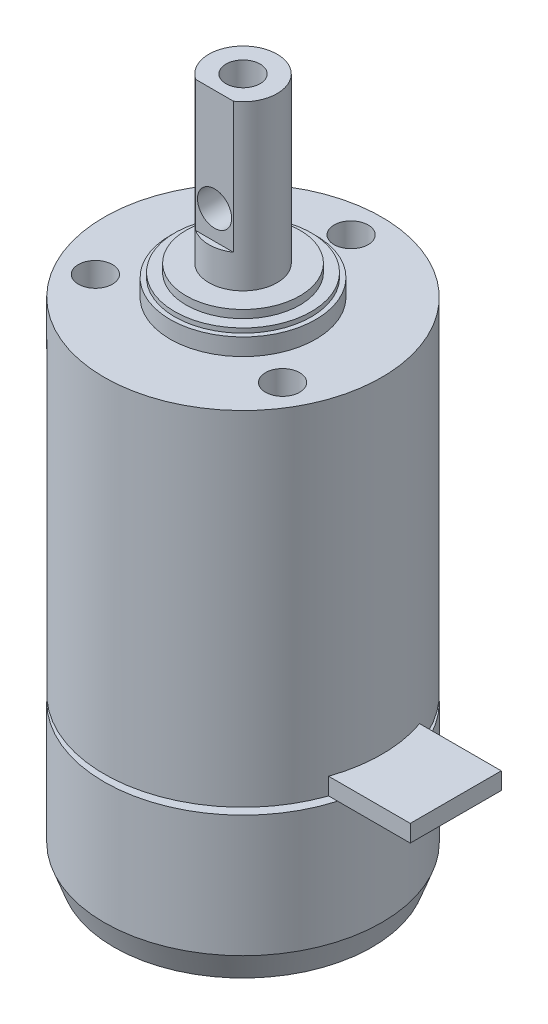
ISO-10303-21;
HEADER;
FILE_DESCRIPTION(('STEP AP214'),'2;1');
FILE_NAME('part.step','',(''),(''),'','','');
FILE_SCHEMA(('AUTOMOTIVE_DESIGN { 1 0 10303 214 1 1 1 1 }'));
ENDSEC;
DATA;
#1=APPLICATION_CONTEXT('core data for automotive mechanical design processes');
#2=APPLICATION_PROTOCOL_DEFINITION('international standard','automotive_design',2000,#1);
#3=PRODUCT_CONTEXT('',#1,'mechanical');
#4=PRODUCT('Part','Part','',(#3));
#5=PRODUCT_RELATED_PRODUCT_CATEGORY('part','',(#4));
#6=PRODUCT_DEFINITION_FORMATION('','',#4);
#7=PRODUCT_DEFINITION_CONTEXT('part definition',#1,'design');
#8=PRODUCT_DEFINITION('design','',#6,#7);
#9=PRODUCT_DEFINITION_SHAPE('','',#8);
#10=(LENGTH_UNIT() NAMED_UNIT(*) SI_UNIT(.MILLI.,.METRE.));
#11=(NAMED_UNIT(*) PLANE_ANGLE_UNIT() SI_UNIT($,.RADIAN.));
#12=(NAMED_UNIT(*) SI_UNIT($,.STERADIAN.) SOLID_ANGLE_UNIT());
#13=UNCERTAINTY_MEASURE_WITH_UNIT(LENGTH_MEASURE(1.E-05),#10,'distance_accuracy_value','');
#14=(GEOMETRIC_REPRESENTATION_CONTEXT(3) GLOBAL_UNCERTAINTY_ASSIGNED_CONTEXT((#13)) GLOBAL_UNIT_ASSIGNED_CONTEXT((#10,
#11,#12)) REPRESENTATION_CONTEXT('',''));
#15=CARTESIAN_POINT('',(0.,0.,0.));
#16=DIRECTION('',(0.,0.,1.));
#17=DIRECTION('',(1.,0.,0.));
#18=AXIS2_PLACEMENT_3D('',#15,#16,#17);
#19=CARTESIAN_POINT('',(0.,43.8,0.));
#20=DIRECTION('',(0.,-1.,0.));
#21=DIRECTION('',(0.,0.,-1.));
#22=AXIS2_PLACEMENT_3D('',#19,#20,#21);
#23=CYLINDRICAL_SURFACE('',#22,12.2);
#24=CARTESIAN_POINT('',(0.,13.6,0.));
#25=DIRECTION('',(0.,-1.,0.));
#26=DIRECTION('',(0.,0.,-1.));
#27=AXIS2_PLACEMENT_3D('',#24,#25,#26);
#28=CIRCLE('',#27,12.2);
#29=CARTESIAN_POINT('',(11.5256236273791,13.6,4.));
#30=VERTEX_POINT('',#29);
#31=CARTESIAN_POINT('',(11.5256236273922,13.6,-4.));
#32=VERTEX_POINT('',#31);
#33=EDGE_CURVE('E136',#30,#32,#28,.T.);
#34=ORIENTED_EDGE('',*,*,#33,.F.);
#35=DIRECTION('',(0.,-1.,0.));
#36=VECTOR('',#35,1.);
#37=CARTESIAN_POINT('',(11.5256236273791,43.8,3.99999999999998));
#38=LINE('',#37,#36);
#39=CARTESIAN_POINT('',(11.5256236273791,15.1,4.));
#40=VERTEX_POINT('',#39);
#41=EDGE_CURVE('E95',#40,#30,#38,.T.);
#42=ORIENTED_EDGE('',*,*,#41,.F.);
#43=CARTESIAN_POINT('',(0.,15.1,0.));
#44=DIRECTION('',(0.,1.,0.));
#45=DIRECTION('',(0.,0.,1.));
#46=AXIS2_PLACEMENT_3D('',#43,#44,#45);
#47=CIRCLE('',#46,12.2);
#48=CARTESIAN_POINT('',(11.5256236273791,15.1,-4.));
#49=VERTEX_POINT('',#48);
#50=EDGE_CURVE('E97',#49,#40,#47,.F.);
#51=ORIENTED_EDGE('',*,*,#50,.F.);
#52=DIRECTION('',(0.,-1.,0.));
#53=VECTOR('',#52,1.);
#54=CARTESIAN_POINT('',(11.5256236273791,43.8,-4.00000000000002));
#55=LINE('',#54,#53);
#56=EDGE_CURVE('E126',#32,#49,#55,.F.);
#57=ORIENTED_EDGE('',*,*,#56,.F.);
#58=EDGE_LOOP('',(#34,#42,#51,#57));
#59=FACE_BOUND('',#58,.T.);
#60=CARTESIAN_POINT('',(0.,43.8,0.));
#61=DIRECTION('',(0.,1.,0.));
#62=DIRECTION('',(0.,0.,1.));
#63=AXIS2_PLACEMENT_3D('',#60,#61,#62);
#64=CIRCLE('',#63,12.2);
#65=CARTESIAN_POINT('',(0.,43.8,12.2));
#66=VERTEX_POINT('',#65);
#67=EDGE_CURVE('E546',#66,#66,#64,.T.);
#68=ORIENTED_EDGE('',*,*,#67,.F.);
#69=EDGE_LOOP('',(#68));
#70=FACE_BOUND('',#69,.T.);
#71=ADVANCED_FACE('F36',(#59,#70),#23,.T.);
#72=CARTESIAN_POINT('',(0.,43.8,0.));
#73=DIRECTION('',(0.,1.,0.));
#74=DIRECTION('',(0.,0.,1.));
#75=AXIS2_PLACEMENT_3D('',#72,#73,#74);
#76=PLANE('',#75);
#77=CARTESIAN_POINT('',(0.,43.8,0.));
#78=DIRECTION('',(0.,1.,0.));
#79=DIRECTION('',(0.,0.,1.));
#80=AXIS2_PLACEMENT_3D('',#77,#78,#79);
#81=CIRCLE('',#80,6.4);
#82=CARTESIAN_POINT('',(0.,43.8,6.4));
#83=VERTEX_POINT('',#82);
#84=EDGE_CURVE('E568',#83,#83,#81,.T.);
#85=ORIENTED_EDGE('',*,*,#84,.F.);
#86=EDGE_LOOP('',(#85));
#87=FACE_BOUND('',#86,.T.);
#88=CARTESIAN_POINT('',(-8.22724133595218,43.8,4.74999999999998));
#89=DIRECTION('',(0.,1.,0.));
#90=DIRECTION('',(0.,0.,1.));
#91=AXIS2_PLACEMENT_3D('',#88,#89,#90);
#92=CIRCLE('',#91,1.5);
#93=CARTESIAN_POINT('',(-8.22724133595218,43.8,6.24999999999998));
#94=VERTEX_POINT('',#93);
#95=EDGE_CURVE('E563',#94,#94,#92,.T.);
#96=ORIENTED_EDGE('',*,*,#95,.F.);
#97=EDGE_LOOP('',(#96));
#98=FACE_BOUND('',#97,.T.);
#99=CARTESIAN_POINT('',(8.22724133595218,43.8,4.74999999999998));
#100=DIRECTION('',(0.,1.,0.));
#101=DIRECTION('',(0.,0.,1.));
#102=AXIS2_PLACEMENT_3D('',#99,#100,#101);
#103=CIRCLE('',#102,1.5);
#104=CARTESIAN_POINT('',(8.22724133595218,43.8,6.24999999999998));
#105=VERTEX_POINT('',#104);
#106=EDGE_CURVE('E556',#105,#105,#103,.T.);
#107=ORIENTED_EDGE('',*,*,#106,.F.);
#108=EDGE_LOOP('',(#107));
#109=FACE_BOUND('',#108,.T.);
#110=CARTESIAN_POINT('',(0.,43.8,-9.5));
#111=DIRECTION('',(0.,1.,0.));
#112=DIRECTION('',(0.,0.,1.));
#113=AXIS2_PLACEMENT_3D('',#110,#111,#112);
#114=CIRCLE('',#113,1.5);
#115=CARTESIAN_POINT('',(0.,43.8,-8.));
#116=VERTEX_POINT('',#115);
#117=EDGE_CURVE('E550',#116,#116,#114,.T.);
#118=ORIENTED_EDGE('',*,*,#117,.F.);
#119=EDGE_LOOP('',(#118));
#120=FACE_BOUND('',#119,.T.);
#121=ORIENTED_EDGE('',*,*,#67,.T.);
#122=EDGE_LOOP('',(#121));
#123=FACE_BOUND('',#122,.T.);
#124=ADVANCED_FACE('F190',(#87,#98,#109,#120,#123),#76,.T.);
#125=CARTESIAN_POINT('',(0.,39.8,-9.5));
#126=DIRECTION('',(0.,1.,0.));
#127=DIRECTION('',(0.,0.,1.));
#128=AXIS2_PLACEMENT_3D('',#125,#126,#127);
#129=CYLINDRICAL_SURFACE('',#128,1.5);
#130=CARTESIAN_POINT('',(0.,39.8,-9.5));
#131=DIRECTION('',(0.,1.,0.));
#132=DIRECTION('',(0.,0.,1.));
#133=AXIS2_PLACEMENT_3D('',#130,#131,#132);
#134=CIRCLE('',#133,1.5);
#135=CARTESIAN_POINT('',(0.,39.8,-8.));
#136=VERTEX_POINT('',#135);
#137=EDGE_CURVE('E549',#136,#136,#134,.T.);
#138=ORIENTED_EDGE('',*,*,#137,.F.);
#139=EDGE_LOOP('',(#138));
#140=FACE_BOUND('',#139,.T.);
#141=ORIENTED_EDGE('',*,*,#117,.T.);
#142=EDGE_LOOP('',(#141));
#143=FACE_BOUND('',#142,.T.);
#144=ADVANCED_FACE('F197',(#140,#143),#129,.F.);
#145=CARTESIAN_POINT('',(0.,39.8,-9.5));
#146=DIRECTION('',(0.,1.,0.));
#147=DIRECTION('',(0.,0.,1.));
#148=AXIS2_PLACEMENT_3D('',#145,#146,#147);
#149=PLANE('',#148);
#150=ORIENTED_EDGE('',*,*,#137,.T.);
#151=EDGE_LOOP('',(#150));
#152=FACE_BOUND('',#151,.T.);
#153=ADVANCED_FACE('F630',(#152),#149,.T.);
#154=CARTESIAN_POINT('',(8.22724133595218,39.8,4.74999999999998));
#155=DIRECTION('',(0.,1.,0.));
#156=DIRECTION('',(0.,0.,1.));
#157=AXIS2_PLACEMENT_3D('',#154,#155,#156);
#158=CYLINDRICAL_SURFACE('',#157,1.5);
#159=CARTESIAN_POINT('',(8.22724133595218,39.8,4.74999999999998));
#160=DIRECTION('',(0.,1.,0.));
#161=DIRECTION('',(0.,0.,1.));
#162=AXIS2_PLACEMENT_3D('',#159,#160,#161);
#163=CIRCLE('',#162,1.5);
#164=CARTESIAN_POINT('',(8.22724133595218,39.8,6.24999999999998));
#165=VERTEX_POINT('',#164);
#166=EDGE_CURVE('E559',#165,#165,#163,.T.);
#167=ORIENTED_EDGE('',*,*,#166,.F.);
#168=EDGE_LOOP('',(#167));
#169=FACE_BOUND('',#168,.T.);
#170=ORIENTED_EDGE('',*,*,#106,.T.);
#171=EDGE_LOOP('',(#170));
#172=FACE_BOUND('',#171,.T.);
#173=ADVANCED_FACE('F273',(#169,#172),#158,.F.);
#174=CARTESIAN_POINT('',(8.22724133595218,39.8,4.74999999999998));
#175=DIRECTION('',(0.,1.,0.));
#176=DIRECTION('',(0.,0.,1.));
#177=AXIS2_PLACEMENT_3D('',#174,#175,#176);
#178=PLANE('',#177);
#179=ORIENTED_EDGE('',*,*,#166,.T.);
#180=EDGE_LOOP('',(#179));
#181=FACE_BOUND('',#180,.T.);
#182=ADVANCED_FACE('F640',(#181),#178,.T.);
#183=CARTESIAN_POINT('',(-8.22724133595218,39.8,4.74999999999998));
#184=DIRECTION('',(0.,1.,0.));
#185=DIRECTION('',(0.,0.,1.));
#186=AXIS2_PLACEMENT_3D('',#183,#184,#185);
#187=CYLINDRICAL_SURFACE('',#186,1.5);
#188=CARTESIAN_POINT('',(-8.22724133595218,39.8,4.74999999999998));
#189=DIRECTION('',(0.,1.,0.));
#190=DIRECTION('',(0.,0.,1.));
#191=AXIS2_PLACEMENT_3D('',#188,#189,#190);
#192=CIRCLE('',#191,1.5);
#193=CARTESIAN_POINT('',(-8.22724133595218,39.8,6.24999999999998));
#194=VERTEX_POINT('',#193);
#195=EDGE_CURVE('E553',#194,#194,#192,.T.);
#196=ORIENTED_EDGE('',*,*,#195,.F.);
#197=EDGE_LOOP('',(#196));
#198=FACE_BOUND('',#197,.T.);
#199=ORIENTED_EDGE('',*,*,#95,.T.);
#200=EDGE_LOOP('',(#199));
#201=FACE_BOUND('',#200,.T.);
#202=ADVANCED_FACE('F644',(#198,#201),#187,.F.);
#203=CARTESIAN_POINT('',(-8.22724133595218,39.8,4.74999999999998));
#204=DIRECTION('',(0.,1.,0.));
#205=DIRECTION('',(0.,0.,1.));
#206=AXIS2_PLACEMENT_3D('',#203,#204,#205);
#207=PLANE('',#206);
#208=ORIENTED_EDGE('',*,*,#195,.T.);
#209=EDGE_LOOP('',(#208));
#210=FACE_BOUND('',#209,.T.);
#211=ADVANCED_FACE('F296',(#210),#207,.T.);
#212=CARTESIAN_POINT('',(0.,45.3,0.));
#213=DIRECTION('',(0.,-1.,0.));
#214=DIRECTION('',(0.,0.,-1.));
#215=AXIS2_PLACEMENT_3D('',#212,#213,#214);
#216=CYLINDRICAL_SURFACE('',#215,6.4);
#217=CARTESIAN_POINT('',(0.,45.3,0.));
#218=DIRECTION('',(0.,1.,0.));
#219=DIRECTION('',(0.,0.,1.));
#220=AXIS2_PLACEMENT_3D('',#217,#218,#219);
#221=CIRCLE('',#220,6.4);
#222=CARTESIAN_POINT('',(0.,45.3,6.4));
#223=VERTEX_POINT('',#222);
#224=EDGE_CURVE('E560',#223,#223,#221,.T.);
#225=ORIENTED_EDGE('',*,*,#224,.F.);
#226=EDGE_LOOP('',(#225));
#227=FACE_BOUND('',#226,.T.);
#228=ORIENTED_EDGE('',*,*,#84,.T.);
#229=EDGE_LOOP('',(#228));
#230=FACE_BOUND('',#229,.T.);
#231=ADVANCED_FACE('F284',(#227,#230),#216,.T.);
#232=CARTESIAN_POINT('',(0.,45.3,0.));
#233=DIRECTION('',(0.,1.,0.));
#234=DIRECTION('',(0.,0.,1.));
#235=AXIS2_PLACEMENT_3D('',#232,#233,#234);
#236=PLANE('',#235);
#237=CARTESIAN_POINT('',(0.,45.3,0.));
#238=DIRECTION('',(0.,1.,0.));
#239=DIRECTION('',(0.,0.,1.));
#240=AXIS2_PLACEMENT_3D('',#237,#238,#239);
#241=CIRCLE('',#240,6.);
#242=CARTESIAN_POINT('',(0.,45.3,6.));
#243=VERTEX_POINT('',#242);
#244=EDGE_CURVE('E574',#243,#243,#241,.T.);
#245=ORIENTED_EDGE('',*,*,#244,.F.);
#246=EDGE_LOOP('',(#245));
#247=FACE_BOUND('',#246,.T.);
#248=ORIENTED_EDGE('',*,*,#224,.T.);
#249=EDGE_LOOP('',(#248));
#250=FACE_BOUND('',#249,.T.);
#251=ADVANCED_FACE('F278',(#247,#250),#236,.T.);
#252=CARTESIAN_POINT('',(0.,45.7,0.));
#253=DIRECTION('',(0.,-1.,0.));
#254=DIRECTION('',(0.,0.,-1.));
#255=AXIS2_PLACEMENT_3D('',#252,#253,#254);
#256=CYLINDRICAL_SURFACE('',#255,6.);
#257=CARTESIAN_POINT('',(0.,45.7,0.));
#258=DIRECTION('',(0.,1.,0.));
#259=DIRECTION('',(0.,0.,1.));
#260=AXIS2_PLACEMENT_3D('',#257,#258,#259);
#261=CIRCLE('',#260,6.);
#262=CARTESIAN_POINT('',(0.,45.7,6.));
#263=VERTEX_POINT('',#262);
#264=EDGE_CURVE('E571',#263,#263,#261,.T.);
#265=ORIENTED_EDGE('',*,*,#264,.F.);
#266=EDGE_LOOP('',(#265));
#267=FACE_BOUND('',#266,.T.);
#268=ORIENTED_EDGE('',*,*,#244,.T.);
#269=EDGE_LOOP('',(#268));
#270=FACE_BOUND('',#269,.T.);
#271=ADVANCED_FACE('F283',(#267,#270),#256,.T.);
#272=CARTESIAN_POINT('',(0.,45.7,0.));
#273=DIRECTION('',(0.,1.,0.));
#274=DIRECTION('',(0.,0.,1.));
#275=AXIS2_PLACEMENT_3D('',#272,#273,#274);
#276=PLANE('',#275);
#277=CARTESIAN_POINT('',(0.,45.7,0.));
#278=DIRECTION('',(0.,1.,0.));
#279=DIRECTION('',(0.,0.,1.));
#280=AXIS2_PLACEMENT_3D('',#277,#278,#279);
#281=CIRCLE('',#280,5.);
#282=CARTESIAN_POINT('',(0.,45.7,5.));
#283=VERTEX_POINT('',#282);
#284=EDGE_CURVE('E580',#283,#283,#281,.T.);
#285=ORIENTED_EDGE('',*,*,#284,.F.);
#286=EDGE_LOOP('',(#285));
#287=FACE_BOUND('',#286,.T.);
#288=ORIENTED_EDGE('',*,*,#264,.T.);
#289=EDGE_LOOP('',(#288));
#290=FACE_BOUND('',#289,.T.);
#291=ADVANCED_FACE('F305',(#287,#290),#276,.T.);
#292=CARTESIAN_POINT('',(0.,46.4,0.));
#293=DIRECTION('',(0.,-1.,0.));
#294=DIRECTION('',(0.,0.,-1.));
#295=AXIS2_PLACEMENT_3D('',#292,#293,#294);
#296=CYLINDRICAL_SURFACE('',#295,5.);
#297=CARTESIAN_POINT('',(0.,46.4,0.));
#298=DIRECTION('',(0.,1.,0.));
#299=DIRECTION('',(0.,0.,1.));
#300=AXIS2_PLACEMENT_3D('',#297,#298,#299);
#301=CIRCLE('',#300,5.);
#302=CARTESIAN_POINT('',(0.,46.4,5.));
#303=VERTEX_POINT('',#302);
#304=EDGE_CURVE('E577',#303,#303,#301,.T.);
#305=ORIENTED_EDGE('',*,*,#304,.F.);
#306=EDGE_LOOP('',(#305));
#307=FACE_BOUND('',#306,.T.);
#308=ORIENTED_EDGE('',*,*,#284,.T.);
#309=EDGE_LOOP('',(#308));
#310=FACE_BOUND('',#309,.T.);
#311=ADVANCED_FACE('F315',(#307,#310),#296,.T.);
#312=CARTESIAN_POINT('',(0.,46.4,0.));
#313=DIRECTION('',(0.,1.,0.));
#314=DIRECTION('',(0.,0.,1.));
#315=AXIS2_PLACEMENT_3D('',#312,#313,#314);
#316=PLANE('',#315);
#317=CARTESIAN_POINT('',(0.,46.4,0.));
#318=DIRECTION('',(0.,1.,0.));
#319=DIRECTION('',(0.,0.,1.));
#320=AXIS2_PLACEMENT_3D('',#317,#318,#319);
#321=CIRCLE('',#320,3.);
#322=CARTESIAN_POINT('',(0.,46.4,3.));
#323=VERTEX_POINT('',#322);
#324=EDGE_CURVE('E586',#323,#323,#321,.T.);
#325=ORIENTED_EDGE('',*,*,#324,.F.);
#326=EDGE_LOOP('',(#325));
#327=FACE_BOUND('',#326,.T.);
#328=ORIENTED_EDGE('',*,*,#304,.T.);
#329=EDGE_LOOP('',(#328));
#330=FACE_BOUND('',#329,.T.);
#331=ADVANCED_FACE('F186',(#327,#330),#316,.T.);
#332=CARTESIAN_POINT('',(0.,60.8,0.));
#333=DIRECTION('',(0.,-1.,0.));
#334=DIRECTION('',(0.,0.,-1.));
#335=AXIS2_PLACEMENT_3D('',#332,#333,#334);
#336=CYLINDRICAL_SURFACE('',#335,3.);
#337=CARTESIAN_POINT('',(0.,53.3,-3.));
#338=CARTESIAN_POINT('',(-0.07885794442685,53.2999950465242,-2.99999570107562));
#339=CARTESIAN_POINT('',(-0.157809899546344,53.2937448903184,-2.99685736529635));
#340=CARTESIAN_POINT('',(-0.313380352903344,53.2690206794877,-2.98461234055736));
#341=CARTESIAN_POINT('',(-0.389994130070444,53.2505234105033,-2.97549431743379));
#342=CARTESIAN_POINT('',(-0.538400317320673,53.202209287075,-2.95224419105063));
#343=CARTESIAN_POINT('',(-0.610210204408719,53.172436423628,-2.93813158766306));
#344=CARTESIAN_POINT('',(-0.747708925209898,53.1026440679525,-2.90618664773642));
#345=CARTESIAN_POINT('',(-0.813398240985089,53.0626253836267,-2.88835460450288));
#346=CARTESIAN_POINT('',(-0.941261726642863,52.9707241257721,-2.84934387387093));
#347=CARTESIAN_POINT('',(-1.00298281668316,52.9182702811405,-2.82802798691306));
#348=CARTESIAN_POINT('',(-1.11716916730047,52.8042177811294,-2.78489955370115));
#349=CARTESIAN_POINT('',(-1.16962737466015,52.7426122223413,-2.76308664313552));
#350=CARTESIAN_POINT('',(-1.26787800067542,52.6062749757149,-2.71948426796021));
#351=CARTESIAN_POINT('',(-1.31283800332746,52.5308958524811,-2.69782780455198));
#352=CARTESIAN_POINT('',(-1.38925234033604,52.3724489960207,-2.65928968158481));
#353=CARTESIAN_POINT('',(-1.4207163224495,52.2893868069159,-2.64240461410484));
#354=CARTESIAN_POINT('',(-1.46719866328288,52.1230023418671,-2.61686800556713));
#355=CARTESIAN_POINT('',(-1.48308878562066,52.0399933218989,-2.6077840737557));
#356=CARTESIAN_POINT('',(-1.50064048996327,51.8720317433308,-2.59772834922792));
#357=CARTESIAN_POINT('',(-1.50231613255961,51.7870811886933,-2.59674854014932));
#358=CARTESIAN_POINT('',(-1.49203093075844,51.6285709635269,-2.60266395385873));
#359=CARTESIAN_POINT('',(-1.48167683930523,51.5548639531654,-2.6086314549302));
#360=CARTESIAN_POINT('',(-1.4504097735854,51.4104171359404,-2.62614343100776));
#361=CARTESIAN_POINT('',(-1.42949343584648,51.339678282042,-2.63768968247665));
#362=CARTESIAN_POINT('',(-1.377314670579,51.2011563011515,-2.66531214619112));
#363=CARTESIAN_POINT('',(-1.34582260067399,51.1334804018213,-2.68148760995998));
#364=CARTESIAN_POINT('',(-1.273562531502,51.004048561115,-2.71655106422106));
#365=CARTESIAN_POINT('',(-1.2327903657187,50.9422952965999,-2.73544027170286));
#366=CARTESIAN_POINT('',(-1.13709908236918,50.8182181208851,-2.77669736854929));
#367=CARTESIAN_POINT('',(-1.08104168755392,50.7568146896358,-2.79920265355119));
#368=CARTESIAN_POINT('',(-0.959333368112052,50.6438968721136,-2.84321434950611));
#369=CARTESIAN_POINT('',(-0.893677884861421,50.5923872119492,-2.86472027938202));
#370=CARTESIAN_POINT('',(-0.750774758747766,50.4984715084554,-2.90552980924446));
#371=CARTESIAN_POINT('',(-0.673130387399105,50.4565992913314,-2.92468476243011));
#372=CARTESIAN_POINT('',(-0.510699323233187,50.3868544564355,-2.95736821681864));
#373=CARTESIAN_POINT('',(-0.425918364397906,50.3589707224772,-2.9709011841533));
#374=CARTESIAN_POINT('',(-0.259149737491047,50.320286894425,-2.98986500612153));
#375=CARTESIAN_POINT('',(-0.177512295822484,50.3082631463798,-2.99587407451965));
#376=CARTESIAN_POINT('',(-0.0131693999240231,50.2978029032983,-3.00109520188655));
#377=CARTESIAN_POINT('',(0.0695355298048667,50.2993599715408,-3.00031048081978));
#378=CARTESIAN_POINT('',(0.226849457978983,50.3153100326281,-2.99236788380152));
#379=CARTESIAN_POINT('',(0.301589112074897,50.328698799095,-2.98570868532252));
#380=CARTESIAN_POINT('',(0.447610338452913,50.3663571078427,-2.9673325697226));
#381=CARTESIAN_POINT('',(0.518891528536632,50.3906278496802,-2.95561509501618));
#382=CARTESIAN_POINT('',(0.65833291267436,50.4499976996495,-2.92776377120382));
#383=CARTESIAN_POINT('',(0.726345595508707,50.4853865751744,-2.91151322654446));
#384=CARTESIAN_POINT('',(0.855692042548909,50.5656613034698,-2.87615961476126));
#385=CARTESIAN_POINT('',(0.917022944664889,50.6105512018931,-2.85705533350407));
#386=CARTESIAN_POINT('',(1.03765153393382,50.7136406379961,-2.81562332004297));
#387=CARTESIAN_POINT('',(1.09615811672854,50.7727143026677,-2.79316327265249));
#388=CARTESIAN_POINT('',(1.20278448167829,50.8998877269166,-2.7489358741323));
#389=CARTESIAN_POINT('',(1.25089707856781,50.9679936782719,-2.7271690110007));
#390=CARTESIAN_POINT('',(1.33756187171853,51.1154654812595,-2.68576788309734));
#391=CARTESIAN_POINT('',(1.37553824370038,51.1952168991417,-2.66628794383591));
#392=CARTESIAN_POINT('',(1.43712423890206,51.3612651013624,-2.63361108441202));
#393=CARTESIAN_POINT('',(1.46075237380053,51.4475532897003,-2.62040607332625));
#394=CARTESIAN_POINT('',(1.49079253120031,51.6153653343271,-2.60342251538703));
#395=CARTESIAN_POINT('',(1.49863949460818,51.6965513801529,-2.59886075197597));
#396=CARTESIAN_POINT('',(1.5010337315643,51.8591706007468,-2.59748031962405));
#397=CARTESIAN_POINT('',(1.49558676993486,51.9406036531068,-2.60065829439585));
#398=CARTESIAN_POINT('',(1.47288918838996,52.0932252523001,-2.61356793076615));
#399=CARTESIAN_POINT('',(1.45681247151455,52.1646507052171,-2.62264641723988));
#400=CARTESIAN_POINT('',(1.41476303733662,52.3037121791365,-2.64556524281479));
#401=CARTESIAN_POINT('',(1.38878713673988,52.371346973138,-2.65940711354503));
#402=CARTESIAN_POINT('',(1.32572361795085,52.5059372764798,-2.69142795546803));
#403=CARTESIAN_POINT('',(1.28800670672355,52.5725418527435,-2.70983583593881));
#404=CARTESIAN_POINT('',(1.20322645745609,52.6989118042719,-2.7485299745229));
#405=CARTESIAN_POINT('',(1.15615825686235,52.7586735957817,-2.76881720693416));
#406=CARTESIAN_POINT('',(1.04730498999206,52.877212973532,-2.81193484737138));
#407=CARTESIAN_POINT('',(0.98442663449589,52.9349886535254,-2.83477474959942));
#408=CARTESIAN_POINT('',(0.849232209349791,53.0393944751529,-2.87816628389896));
#409=CARTESIAN_POINT('',(0.77691108495779,53.0860186092049,-2.89871667939293));
#410=CARTESIAN_POINT('',(0.623897395174413,53.1668545440681,-2.93547014349806));
#411=CARTESIAN_POINT('',(0.543149255665092,53.2009762538547,-2.95164144740899));
#412=CARTESIAN_POINT('',(0.376113151707129,53.2547122516361,-2.9775201194848));
#413=CARTESIAN_POINT('',(0.28984169938365,53.2743677702086,-2.98724585044602));
#414=CARTESIAN_POINT('',(0.168902919736344,53.2908461166286,-2.99543192870217));
#415=CARTESIAN_POINT('',(0.135242819162349,53.2942739612995,-2.99714048010376));
#416=CARTESIAN_POINT('',(0.0677275977076386,53.2988519982711,-2.99942545465223));
#417=CARTESIAN_POINT('',(0.0338724714699433,53.3000021277053,-3.00000184655071));
#418=CARTESIAN_POINT('',(0.,53.3,-3.));
#419=B_SPLINE_CURVE_WITH_KNOTS('',3,(#337,#338,#339,#340,#341,#342,#343,#344,#345,#346,#347,
#348,#349,#350,#351,#352,#353,#354,#355,#356,#357,#358,#359,#360,#361,#362,#363,#364,#365,#366,
#367,#368,#369,#370,#371,#372,#373,#374,#375,#376,#377,#378,#379,#380,#381,#382,#383,#384,#385,
#386,#387,#388,#389,#390,#391,#392,#393,#394,#395,#396,#397,#398,#399,#400,#401,#402,#403,#404,
#405,#406,#407,#408,#409,#410,#411,#412,#413,#414,#415,#416,#417,#418),.UNSPECIFIED.,.T.,.F.,(4,
2,2,2,2,2,2,2,2,2,2,2,2,2,2,2,2,2,2,2,2,2,2,2,2,2,2,2,2,2,2,2,2,2,2,2,2,2,2,2,4),(0.,
0.236436386130438,0.473322224563798,0.709293233238447,0.945245640872352,1.19547263807713,
1.44588935648105,1.71572589646129,1.98536921847422,2.23887018210345,2.49212035993531,
2.71508568613981,2.93812205888519,3.16635360252732,3.39468781890333,3.65197412000818,
3.90938301898031,4.17874533321662,4.4478932536842,4.69474935707019,4.94148846767214,
5.16910359759183,5.39674382446397,5.63089284041848,5.86514176122509,6.12239415966628,
6.37982382923148,6.64972023242589,6.91926767918177,7.16293961254569,7.40650589797017,
7.62686895373284,7.84730293182527,8.0825468517043,8.31791341715446,8.58187864135758,
8.8459857507187,9.1119602049529,9.37717362931724,9.47872920200875,9.58028757766599),.UNSPECIFIED.);
#420=CARTESIAN_POINT('',(0.,53.3,-3.));
#421=VERTEX_POINT('',#420);
#422=EDGE_CURVE('E143',#421,#421,#419,.T.);
#423=ORIENTED_EDGE('',*,*,#422,.T.);
#424=EDGE_LOOP('',(#423));
#425=FACE_BOUND('',#424,.T.);
#426=CARTESIAN_POINT('',(0.,60.8,0.));
#427=DIRECTION('',(0.,1.,0.));
#428=DIRECTION('',(0.,0.,1.));
#429=AXIS2_PLACEMENT_3D('',#426,#427,#428);
#430=CIRCLE('',#429,3.);
#431=CARTESIAN_POINT('',(1.6583123951777,60.8,2.5));
#432=VERTEX_POINT('',#431);
#433=CARTESIAN_POINT('',(-1.6583123951777,60.8,2.5));
#434=VERTEX_POINT('',#433);
#435=EDGE_CURVE('E583',#432,#434,#430,.T.);
#436=ORIENTED_EDGE('',*,*,#435,.F.);
#437=DIRECTION('',(0.,1.,0.));
#438=VECTOR('',#437,1.);
#439=CARTESIAN_POINT('',(1.6583123951777,49.3,2.5));
#440=LINE('',#439,#438);
#441=CARTESIAN_POINT('',(1.6583123951777,49.3,2.5));
#442=VERTEX_POINT('',#441);
#443=EDGE_CURVE('E59',#442,#432,#440,.T.);
#444=ORIENTED_EDGE('',*,*,#443,.F.);
#445=CARTESIAN_POINT('',(0.,49.3,0.));
#446=DIRECTION('',(0.,1.,0.));
#447=DIRECTION('',(0.,0.,1.));
#448=AXIS2_PLACEMENT_3D('',#445,#446,#447);
#449=CIRCLE('',#448,3.);
#450=CARTESIAN_POINT('',(-1.6583123951777,49.3,2.5));
#451=VERTEX_POINT('',#450);
#452=EDGE_CURVE('E151',#451,#442,#449,.T.);
#453=ORIENTED_EDGE('',*,*,#452,.F.);
#454=DIRECTION('',(0.,1.,0.));
#455=VECTOR('',#454,1.);
#456=CARTESIAN_POINT('',(-1.6583123951777,49.3,2.5));
#457=LINE('',#456,#455);
#458=EDGE_CURVE('E595',#451,#434,#457,.T.);
#459=ORIENTED_EDGE('',*,*,#458,.T.);
#460=EDGE_LOOP('',(#436,#444,#453,#459));
#461=FACE_BOUND('',#460,.T.);
#462=ORIENTED_EDGE('',*,*,#324,.T.);
#463=EDGE_LOOP('',(#462));
#464=FACE_BOUND('',#463,.T.);
#465=ADVANCED_FACE('F153',(#425,#461,#464),#336,.T.);
#466=CARTESIAN_POINT('',(0.,60.8,0.));
#467=DIRECTION('',(0.,1.,0.));
#468=DIRECTION('',(0.,0.,1.));
#469=AXIS2_PLACEMENT_3D('',#466,#467,#468);
#470=PLANE('',#469);
#471=DIRECTION('',(-1.,0.,0.));
#472=VECTOR('',#471,1.);
#473=CARTESIAN_POINT('',(-1.6583123951777,60.8,2.5));
#474=LINE('',#473,#472);
#475=EDGE_CURVE('E150',#432,#434,#474,.T.);
#476=ORIENTED_EDGE('',*,*,#475,.F.);
#477=ORIENTED_EDGE('',*,*,#435,.T.);
#478=EDGE_LOOP('',(#476,#477));
#479=FACE_BOUND('',#478,.T.);
#480=CARTESIAN_POINT('',(0.,60.8,0.));
#481=DIRECTION('',(0.,1.,0.));
#482=DIRECTION('',(0.,0.,1.));
#483=AXIS2_PLACEMENT_3D('',#480,#481,#482);
#484=CIRCLE('',#483,1.5);
#485=CARTESIAN_POINT('',(0.,60.8,1.5));
#486=VERTEX_POINT('',#485);
#487=EDGE_CURVE('E592',#486,#486,#484,.T.);
#488=ORIENTED_EDGE('',*,*,#487,.F.);
#489=EDGE_LOOP('',(#488));
#490=FACE_BOUND('',#489,.T.);
#491=ADVANCED_FACE('F179',(#479,#490),#470,.T.);
#492=CARTESIAN_POINT('',(0.,55.3,0.));
#493=DIRECTION('',(0.,1.,0.));
#494=DIRECTION('',(0.,0.,1.));
#495=AXIS2_PLACEMENT_3D('',#492,#493,#494);
#496=CYLINDRICAL_SURFACE('',#495,1.5);
#497=CARTESIAN_POINT('',(0.,55.3,0.));
#498=DIRECTION('',(0.,1.,0.));
#499=DIRECTION('',(0.,0.,1.));
#500=AXIS2_PLACEMENT_3D('',#497,#498,#499);
#501=CIRCLE('',#500,1.5);
#502=CARTESIAN_POINT('',(0.,55.3,1.5));
#503=VERTEX_POINT('',#502);
#504=EDGE_CURVE('E589',#503,#503,#501,.T.);
#505=ORIENTED_EDGE('',*,*,#504,.F.);
#506=EDGE_LOOP('',(#505));
#507=FACE_BOUND('',#506,.T.);
#508=ORIENTED_EDGE('',*,*,#487,.T.);
#509=EDGE_LOOP('',(#508));
#510=FACE_BOUND('',#509,.T.);
#511=ADVANCED_FACE('F176',(#507,#510),#496,.F.);
#512=CARTESIAN_POINT('',(0.,55.3,0.));
#513=DIRECTION('',(0.,1.,0.));
#514=DIRECTION('',(0.,0.,1.));
#515=AXIS2_PLACEMENT_3D('',#512,#513,#514);
#516=PLANE('',#515);
#517=ORIENTED_EDGE('',*,*,#504,.T.);
#518=EDGE_LOOP('',(#517));
#519=FACE_BOUND('',#518,.T.);
#520=ADVANCED_FACE('F172',(#519),#516,.T.);
#521=CARTESIAN_POINT('',(-1.6583123951777,49.3,2.5));
#522=DIRECTION('',(0.,0.,-1.));
#523=DIRECTION('',(-1.,0.,0.));
#524=AXIS2_PLACEMENT_3D('',#521,#522,#523);
#525=PLANE('',#524);
#526=CARTESIAN_POINT('',(0.,51.8,2.5));
#527=DIRECTION('',(0.,0.,1.));
#528=DIRECTION('',(1.,0.,0.));
#529=AXIS2_PLACEMENT_3D('',#526,#527,#528);
#530=CIRCLE('',#529,1.5);
#531=CARTESIAN_POINT('',(1.5,51.8,2.5));
#532=VERTEX_POINT('',#531);
#533=EDGE_CURVE('E138',#532,#532,#530,.T.);
#534=ORIENTED_EDGE('',*,*,#533,.F.);
#535=EDGE_LOOP('',(#534));
#536=FACE_BOUND('',#535,.T.);
#537=ORIENTED_EDGE('',*,*,#475,.T.);
#538=ORIENTED_EDGE('',*,*,#458,.F.);
#539=DIRECTION('',(-1.,0.,0.));
#540=VECTOR('',#539,1.);
#541=CARTESIAN_POINT('',(-1.6583123951777,49.3,2.5));
#542=LINE('',#541,#540);
#543=EDGE_CURVE('E599',#442,#451,#542,.T.);
#544=ORIENTED_EDGE('',*,*,#543,.F.);
#545=ORIENTED_EDGE('',*,*,#443,.T.);
#546=EDGE_LOOP('',(#537,#538,#544,#545));
#547=FACE_BOUND('',#546,.T.);
#548=ADVANCED_FACE('F168',(#536,#547),#525,.F.);
#549=CARTESIAN_POINT('',(0.,49.3,0.));
#550=DIRECTION('',(0.,1.,0.));
#551=DIRECTION('',(0.,0.,1.));
#552=AXIS2_PLACEMENT_3D('',#549,#550,#551);
#553=PLANE('',#552);
#554=ORIENTED_EDGE('',*,*,#452,.T.);
#555=ORIENTED_EDGE('',*,*,#543,.T.);
#556=EDGE_LOOP('',(#554,#555));
#557=FACE_BOUND('',#556,.T.);
#558=ADVANCED_FACE('F162',(#557),#553,.T.);
#559=CARTESIAN_POINT('',(0.,51.8,-12.2));
#560=DIRECTION('',(0.,0.,1.));
#561=DIRECTION('',(1.,0.,0.));
#562=AXIS2_PLACEMENT_3D('',#559,#560,#561);
#563=CYLINDRICAL_SURFACE('',#562,1.5);
#564=ORIENTED_EDGE('',*,*,#533,.T.);
#565=EDGE_LOOP('',(#564));
#566=FACE_BOUND('',#565,.T.);
#567=ORIENTED_EDGE('',*,*,#422,.F.);
#568=EDGE_LOOP('',(#567));
#569=FACE_BOUND('',#568,.T.);
#570=ADVANCED_FACE('F157',(#566,#569),#563,.F.);
#571=CARTESIAN_POINT('',(0.,13.6,0.));
#572=DIRECTION('',(0.,-1.,0.));
#573=DIRECTION('',(0.,0.,-1.));
#574=AXIS2_PLACEMENT_3D('',#571,#572,#573);
#575=PLANE('',#574);
#576=CARTESIAN_POINT('',(0.,13.6,0.));
#577=DIRECTION('',(0.,-1.,0.));
#578=DIRECTION('',(0.,0.,-1.));
#579=AXIS2_PLACEMENT_3D('',#576,#577,#578);
#580=CIRCLE('',#579,7.);
#581=CARTESIAN_POINT('',(0.,13.6,-7.));
#582=VERTEX_POINT('',#581);
#583=EDGE_CURVE('E130',#582,#582,#580,.T.);
#584=ORIENTED_EDGE('',*,*,#583,.F.);
#585=EDGE_LOOP('',(#584));
#586=FACE_BOUND('',#585,.T.);
#587=ORIENTED_EDGE('',*,*,#33,.T.);
#588=DIRECTION('',(1.,0.,0.));
#589=VECTOR('',#588,1.);
#590=CARTESIAN_POINT('',(-500000.,13.6,-4.));
#591=LINE('',#590,#589);
#592=CARTESIAN_POINT('',(18.7,13.6,-4.));
#593=VERTEX_POINT('',#592);
#594=EDGE_CURVE('E98',#32,#593,#591,.T.);
#595=ORIENTED_EDGE('',*,*,#594,.T.);
#596=DIRECTION('',(0.,0.,-1.));
#597=VECTOR('',#596,1.);
#598=CARTESIAN_POINT('',(18.7,13.6,4.));
#599=LINE('',#598,#597);
#600=CARTESIAN_POINT('',(18.7,13.6,4.));
#601=VERTEX_POINT('',#600);
#602=EDGE_CURVE('E101',#601,#593,#599,.T.);
#603=ORIENTED_EDGE('',*,*,#602,.F.);
#604=DIRECTION('',(1.,0.,0.));
#605=VECTOR('',#604,1.);
#606=CARTESIAN_POINT('',(-500000.,13.6,4.));
#607=LINE('',#606,#605);
#608=EDGE_CURVE('E51',#30,#601,#607,.T.);
#609=ORIENTED_EDGE('',*,*,#608,.F.);
#610=EDGE_LOOP('',(#587,#595,#603,#609));
#611=FACE_BOUND('',#610,.T.);
#612=ADVANCED_FACE('F102',(#586,#611),#575,.T.);
#613=CARTESIAN_POINT('',(0.,13.,0.));
#614=DIRECTION('',(0.,-1.,0.));
#615=DIRECTION('',(0.,0.,-1.));
#616=AXIS2_PLACEMENT_3D('',#613,#614,#615);
#617=PLANE('',#616);
#618=CARTESIAN_POINT('',(0.,13.,0.));
#619=DIRECTION('',(0.,-1.,0.));
#620=DIRECTION('',(0.,0.,-1.));
#621=AXIS2_PLACEMENT_3D('',#618,#619,#620);
#622=CIRCLE('',#621,7.);
#623=CARTESIAN_POINT('',(0.,13.,-7.));
#624=VERTEX_POINT('',#623);
#625=EDGE_CURVE('E129',#624,#624,#622,.T.);
#626=ORIENTED_EDGE('',*,*,#625,.T.);
#627=EDGE_LOOP('',(#626));
#628=FACE_BOUND('',#627,.T.);
#629=CARTESIAN_POINT('',(0.,13.,0.));
#630=DIRECTION('',(0.,-1.,0.));
#631=DIRECTION('',(0.,0.,-1.));
#632=AXIS2_PLACEMENT_3D('',#629,#630,#631);
#633=CIRCLE('',#632,12.2);
#634=CARTESIAN_POINT('',(0.,13.,-12.2));
#635=VERTEX_POINT('',#634);
#636=EDGE_CURVE('E133',#635,#635,#633,.T.);
#637=ORIENTED_EDGE('',*,*,#636,.F.);
#638=EDGE_LOOP('',(#637));
#639=FACE_BOUND('',#638,.T.);
#640=ADVANCED_FACE('F164',(#628,#639),#617,.F.);
#641=CARTESIAN_POINT('',(0.,13.6,0.));
#642=DIRECTION('',(0.,-1.,0.));
#643=DIRECTION('',(0.,0.,-1.));
#644=AXIS2_PLACEMENT_3D('',#641,#642,#643);
#645=CYLINDRICAL_SURFACE('',#644,7.);
#646=ORIENTED_EDGE('',*,*,#583,.T.);
#647=EDGE_LOOP('',(#646));
#648=FACE_BOUND('',#647,.T.);
#649=ORIENTED_EDGE('',*,*,#625,.F.);
#650=EDGE_LOOP('',(#649));
#651=FACE_BOUND('',#650,.T.);
#652=ADVANCED_FACE('F232',(#648,#651),#645,.T.);
#653=CARTESIAN_POINT('',(0.,0.,0.));
#654=DIRECTION('',(0.,1.,0.));
#655=DIRECTION('',(0.,0.,1.));
#656=AXIS2_PLACEMENT_3D('',#653,#654,#655);
#657=PLANE('',#656);
#658=CARTESIAN_POINT('',(0.,0.,0.));
#659=DIRECTION('',(0.,1.,0.));
#660=DIRECTION('',(0.,0.,1.));
#661=AXIS2_PLACEMENT_3D('',#658,#659,#660);
#662=CIRCLE('',#661,3.);
#663=CARTESIAN_POINT('',(0.,0.,3.));
#664=VERTEX_POINT('',#663);
#665=EDGE_CURVE('E536',#664,#664,#662,.F.);
#666=ORIENTED_EDGE('',*,*,#665,.F.);
#667=EDGE_LOOP('',(#666));
#668=FACE_BOUND('',#667,.T.);
#669=CARTESIAN_POINT('',(-4.76313972081442,0.,-2.74999999999999));
#670=DIRECTION('',(0.,-1.,0.));
#671=DIRECTION('',(0.,0.,-1.));
#672=AXIS2_PLACEMENT_3D('',#669,#670,#671);
#673=CIRCLE('',#672,1.);
#674=CARTESIAN_POINT('',(-4.76313972081442,0.,-3.74999999999999));
#675=VERTEX_POINT('',#674);
#676=EDGE_CURVE('E744',#675,#675,#673,.T.);
#677=ORIENTED_EDGE('',*,*,#676,.F.);
#678=EDGE_LOOP('',(#677));
#679=FACE_BOUND('',#678,.T.);
#680=CARTESIAN_POINT('',(4.76313972081442,0.,-2.74999999999999));
#681=DIRECTION('',(0.,-1.,0.));
#682=DIRECTION('',(0.,0.,-1.));
#683=AXIS2_PLACEMENT_3D('',#680,#681,#682);
#684=CIRCLE('',#683,0.999999999999999);
#685=CARTESIAN_POINT('',(4.76313972081442,0.,-3.74999999999999));
#686=VERTEX_POINT('',#685);
#687=EDGE_CURVE('E748',#686,#686,#684,.T.);
#688=ORIENTED_EDGE('',*,*,#687,.F.);
#689=EDGE_LOOP('',(#688));
#690=FACE_BOUND('',#689,.T.);
#691=CARTESIAN_POINT('',(0.,0.,5.5));
#692=DIRECTION('',(0.,-1.,0.));
#693=DIRECTION('',(0.,0.,-1.));
#694=AXIS2_PLACEMENT_3D('',#691,#692,#693);
#695=CIRCLE('',#694,1.);
#696=CARTESIAN_POINT('',(0.,0.,4.5));
#697=VERTEX_POINT('',#696);
#698=EDGE_CURVE('E117',#697,#697,#695,.T.);
#699=ORIENTED_EDGE('',*,*,#698,.F.);
#700=EDGE_LOOP('',(#699));
#701=FACE_BOUND('',#700,.T.);
#702=CARTESIAN_POINT('',(0.,0.,0.));
#703=DIRECTION('',(0.,1.,0.));
#704=DIRECTION('',(0.,0.,1.));
#705=AXIS2_PLACEMENT_3D('',#702,#703,#704);
#706=CIRCLE('',#705,11.35);
#707=CARTESIAN_POINT('',(0.,0.,11.35));
#708=VERTEX_POINT('',#707);
#709=EDGE_CURVE('E538',#708,#708,#706,.F.);
#710=ORIENTED_EDGE('',*,*,#709,.T.);
#711=EDGE_LOOP('',(#710));
#712=FACE_BOUND('',#711,.T.);
#713=ADVANCED_FACE('F212',(#668,#679,#690,#701,#712),#657,.F.);
#714=CARTESIAN_POINT('',(0.,2.30000000000003,0.));
#715=DIRECTION('',(0.,1.,0.));
#716=DIRECTION('',(0.,0.,1.));
#717=AXIS2_PLACEMENT_3D('',#714,#715,#716);
#718=CONICAL_SURFACE('',#717,12.2,0.353997436831894);
#719=ORIENTED_EDGE('',*,*,#709,.F.);
#720=EDGE_LOOP('',(#719));
#721=FACE_BOUND('',#720,.T.);
#722=CARTESIAN_POINT('',(0.,2.30000000000003,0.));
#723=DIRECTION('',(0.,1.,0.));
#724=DIRECTION('',(0.,0.,1.));
#725=AXIS2_PLACEMENT_3D('',#722,#723,#724);
#726=CIRCLE('',#725,12.2);
#727=CARTESIAN_POINT('',(0.,2.30000000000003,12.2));
#728=VERTEX_POINT('',#727);
#729=EDGE_CURVE('E543',#728,#728,#726,.T.);
#730=ORIENTED_EDGE('',*,*,#729,.F.);
#731=EDGE_LOOP('',(#730));
#732=FACE_BOUND('',#731,.T.);
#733=ADVANCED_FACE('F203',(#721,#732),#718,.T.);
#734=ORIENTED_EDGE('',*,*,#636,.T.);
#735=EDGE_LOOP('',(#734));
#736=FACE_BOUND('',#735,.T.);
#737=ORIENTED_EDGE('',*,*,#729,.T.);
#738=EDGE_LOOP('',(#737));
#739=FACE_BOUND('',#738,.T.);
#740=ADVANCED_FACE('F193',(#736,#739),#23,.T.);
#741=CARTESIAN_POINT('',(18.7,0.,0.));
#742=DIRECTION('',(-1.,0.,0.));
#743=DIRECTION('',(0.,0.,1.));
#744=AXIS2_PLACEMENT_3D('',#741,#742,#743);
#745=PLANE('',#744);
#746=DIRECTION('',(0.,-1.,0.));
#747=VECTOR('',#746,1.);
#748=CARTESIAN_POINT('',(18.7,13.6,4.));
#749=LINE('',#748,#747);
#750=CARTESIAN_POINT('',(18.7,15.1,4.));
#751=VERTEX_POINT('',#750);
#752=EDGE_CURVE('E93',#751,#601,#749,.T.);
#753=ORIENTED_EDGE('',*,*,#752,.T.);
#754=ORIENTED_EDGE('',*,*,#602,.T.);
#755=DIRECTION('',(0.,1.,0.));
#756=VECTOR('',#755,1.);
#757=CARTESIAN_POINT('',(18.7,13.6,-4.));
#758=LINE('',#757,#756);
#759=CARTESIAN_POINT('',(18.7,15.1,-4.));
#760=VERTEX_POINT('',#759);
#761=EDGE_CURVE('E107',#593,#760,#758,.T.);
#762=ORIENTED_EDGE('',*,*,#761,.T.);
#763=DIRECTION('',(0.,0.,1.));
#764=VECTOR('',#763,1.);
#765=CARTESIAN_POINT('',(18.7,15.1,4.));
#766=LINE('',#765,#764);
#767=EDGE_CURVE('E112',#760,#751,#766,.T.);
#768=ORIENTED_EDGE('',*,*,#767,.T.);
#769=EDGE_LOOP('',(#753,#754,#762,#768));
#770=FACE_BOUND('',#769,.T.);
#771=ADVANCED_FACE('F110',(#770),#745,.F.);
#772=CARTESIAN_POINT('',(-500000.,13.6,4.));
#773=DIRECTION('',(0.,0.,1.));
#774=DIRECTION('',(0.,-1.,0.));
#775=AXIS2_PLACEMENT_3D('',#772,#773,#774);
#776=PLANE('',#775);
#777=DIRECTION('',(1.,0.,0.));
#778=VECTOR('',#777,1.);
#779=CARTESIAN_POINT('',(-500000.,15.1,4.));
#780=LINE('',#779,#778);
#781=EDGE_CURVE('E106',#40,#751,#780,.T.);
#782=ORIENTED_EDGE('',*,*,#781,.F.);
#783=ORIENTED_EDGE('',*,*,#41,.T.);
#784=ORIENTED_EDGE('',*,*,#608,.T.);
#785=ORIENTED_EDGE('',*,*,#752,.F.);
#786=EDGE_LOOP('',(#782,#783,#784,#785));
#787=FACE_BOUND('',#786,.T.);
#788=ADVANCED_FACE('F91',(#787),#776,.T.);
#789=CARTESIAN_POINT('',(-500000.,13.6,-4.));
#790=DIRECTION('',(0.,0.,-1.));
#791=DIRECTION('',(0.,1.,0.));
#792=AXIS2_PLACEMENT_3D('',#789,#790,#791);
#793=PLANE('',#792);
#794=ORIENTED_EDGE('',*,*,#594,.F.);
#795=ORIENTED_EDGE('',*,*,#56,.T.);
#796=DIRECTION('',(1.,0.,0.));
#797=VECTOR('',#796,1.);
#798=CARTESIAN_POINT('',(-500000.,15.1,-4.));
#799=LINE('',#798,#797);
#800=EDGE_CURVE('E122',#49,#760,#799,.T.);
#801=ORIENTED_EDGE('',*,*,#800,.T.);
#802=ORIENTED_EDGE('',*,*,#761,.F.);
#803=EDGE_LOOP('',(#794,#795,#801,#802));
#804=FACE_BOUND('',#803,.T.);
#805=ADVANCED_FACE('F216',(#804),#793,.T.);
#806=CARTESIAN_POINT('',(-500000.,15.1,4.));
#807=DIRECTION('',(0.,1.,0.));
#808=DIRECTION('',(0.,0.,1.));
#809=AXIS2_PLACEMENT_3D('',#806,#807,#808);
#810=PLANE('',#809);
#811=ORIENTED_EDGE('',*,*,#800,.F.);
#812=ORIENTED_EDGE('',*,*,#50,.T.);
#813=ORIENTED_EDGE('',*,*,#781,.T.);
#814=ORIENTED_EDGE('',*,*,#767,.F.);
#815=EDGE_LOOP('',(#811,#812,#813,#814));
#816=FACE_BOUND('',#815,.T.);
#817=ADVANCED_FACE('F205',(#816),#810,.T.);
#818=CARTESIAN_POINT('',(0.,3.,5.5));
#819=DIRECTION('',(0.,-1.,0.));
#820=DIRECTION('',(0.,0.,-1.));
#821=AXIS2_PLACEMENT_3D('',#818,#819,#820);
#822=CYLINDRICAL_SURFACE('',#821,1.);
#823=CARTESIAN_POINT('',(0.,3.,5.5));
#824=DIRECTION('',(0.,-1.,0.));
#825=DIRECTION('',(0.,0.,-1.));
#826=AXIS2_PLACEMENT_3D('',#823,#824,#825);
#827=CIRCLE('',#826,1.);
#828=CARTESIAN_POINT('',(0.,3.,4.5));
#829=VERTEX_POINT('',#828);
#830=EDGE_CURVE('E113',#829,#829,#827,.T.);
#831=ORIENTED_EDGE('',*,*,#830,.F.);
#832=EDGE_LOOP('',(#831));
#833=FACE_BOUND('',#832,.T.);
#834=ORIENTED_EDGE('',*,*,#698,.T.);
#835=EDGE_LOOP('',(#834));
#836=FACE_BOUND('',#835,.T.);
#837=ADVANCED_FACE('F211',(#833,#836),#822,.F.);
#838=CARTESIAN_POINT('',(0.,3.,0.));
#839=DIRECTION('',(0.,-1.,0.));
#840=DIRECTION('',(0.,0.,-1.));
#841=AXIS2_PLACEMENT_3D('',#838,#839,#840);
#842=PLANE('',#841);
#843=ORIENTED_EDGE('',*,*,#830,.T.);
#844=EDGE_LOOP('',(#843));
#845=FACE_BOUND('',#844,.T.);
#846=ADVANCED_FACE('F223',(#845),#842,.T.);
#847=CARTESIAN_POINT('',(4.76313972081442,3.,-2.74999999999999));
#848=DIRECTION('',(0.,-1.,0.));
#849=DIRECTION('',(0.,0.,-1.));
#850=AXIS2_PLACEMENT_3D('',#847,#848,#849);
#851=CYLINDRICAL_SURFACE('',#850,0.999999999999999);
#852=CARTESIAN_POINT('',(4.76313972081442,3.,-2.74999999999999));
#853=DIRECTION('',(0.,-1.,0.));
#854=DIRECTION('',(0.,0.,-1.));
#855=AXIS2_PLACEMENT_3D('',#852,#853,#854);
#856=CIRCLE('',#855,0.999999999999999);
#857=CARTESIAN_POINT('',(4.76313972081442,3.,-3.74999999999999));
#858=VERTEX_POINT('',#857);
#859=EDGE_CURVE('E760',#858,#858,#856,.T.);
#860=ORIENTED_EDGE('',*,*,#859,.F.);
#861=EDGE_LOOP('',(#860));
#862=FACE_BOUND('',#861,.T.);
#863=ORIENTED_EDGE('',*,*,#687,.T.);
#864=EDGE_LOOP('',(#863));
#865=FACE_BOUND('',#864,.T.);
#866=ADVANCED_FACE('F452',(#862,#865),#851,.F.);
#867=CARTESIAN_POINT('',(0.,3.,0.));
#868=DIRECTION('',(0.,-1.,0.));
#869=DIRECTION('',(0.,0.,-1.));
#870=AXIS2_PLACEMENT_3D('',#867,#868,#869);
#871=PLANE('',#870);
#872=ORIENTED_EDGE('',*,*,#859,.T.);
#873=EDGE_LOOP('',(#872));
#874=FACE_BOUND('',#873,.T.);
#875=ADVANCED_FACE('F463',(#874),#871,.T.);
#876=CARTESIAN_POINT('',(-4.76313972081442,3.,-2.74999999999999));
#877=DIRECTION('',(0.,-1.,0.));
#878=DIRECTION('',(0.,0.,-1.));
#879=AXIS2_PLACEMENT_3D('',#876,#877,#878);
#880=CYLINDRICAL_SURFACE('',#879,1.);
#881=CARTESIAN_POINT('',(-4.76313972081442,3.,-2.74999999999999));
#882=DIRECTION('',(0.,-1.,0.));
#883=DIRECTION('',(0.,0.,-1.));
#884=AXIS2_PLACEMENT_3D('',#881,#882,#883);
#885=CIRCLE('',#884,1.);
#886=CARTESIAN_POINT('',(-4.76313972081442,3.,-3.74999999999999));
#887=VERTEX_POINT('',#886);
#888=EDGE_CURVE('E752',#887,#887,#885,.T.);
#889=ORIENTED_EDGE('',*,*,#888,.F.);
#890=EDGE_LOOP('',(#889));
#891=FACE_BOUND('',#890,.T.);
#892=ORIENTED_EDGE('',*,*,#676,.T.);
#893=EDGE_LOOP('',(#892));
#894=FACE_BOUND('',#893,.T.);
#895=ADVANCED_FACE('F475',(#891,#894),#880,.F.);
#896=CARTESIAN_POINT('',(0.,3.,0.));
#897=DIRECTION('',(0.,-1.,0.));
#898=DIRECTION('',(0.,0.,-1.));
#899=AXIS2_PLACEMENT_3D('',#896,#897,#898);
#900=PLANE('',#899);
#901=ORIENTED_EDGE('',*,*,#888,.T.);
#902=EDGE_LOOP('',(#901));
#903=FACE_BOUND('',#902,.T.);
#904=ADVANCED_FACE('F484',(#903),#900,.T.);
#905=CARTESIAN_POINT('',(0.,-4.,0.));
#906=DIRECTION('',(0.,1.,0.));
#907=DIRECTION('',(0.,0.,1.));
#908=AXIS2_PLACEMENT_3D('',#905,#906,#907);
#909=CYLINDRICAL_SURFACE('',#908,3.);
#910=CARTESIAN_POINT('',(0.,-3.80000000000003,0.));
#911=DIRECTION('',(0.,-1.,0.));
#912=DIRECTION('',(0.,0.,-1.));
#913=AXIS2_PLACEMENT_3D('',#910,#911,#912);
#914=CIRCLE('',#913,3.);
#915=CARTESIAN_POINT('',(0.,-3.80000000000003,-3.));
#916=VERTEX_POINT('',#915);
#917=EDGE_CURVE('E11',#916,#916,#914,.F.);
#918=ORIENTED_EDGE('',*,*,#917,.T.);
#919=EDGE_LOOP('',(#918));
#920=FACE_BOUND('',#919,.T.);
#921=ORIENTED_EDGE('',*,*,#665,.T.);
#922=EDGE_LOOP('',(#921));
#923=FACE_BOUND('',#922,.T.);
#924=ADVANCED_FACE('F494',(#920,#923),#909,.T.);
#925=CARTESIAN_POINT('',(0.,-4.,0.));
#926=DIRECTION('',(0.,-1.,0.));
#927=DIRECTION('',(0.,0.,-1.));
#928=AXIS2_PLACEMENT_3D('',#925,#926,#927);
#929=PLANE('',#928);
#930=CARTESIAN_POINT('',(0.,-4.,0.));
#931=DIRECTION('',(0.,-1.,0.));
#932=DIRECTION('',(0.,0.,-1.));
#933=AXIS2_PLACEMENT_3D('',#930,#931,#932);
#934=CIRCLE('',#933,2.90000000000002);
#935=CARTESIAN_POINT('',(0.,-4.,-2.90000000000002));
#936=VERTEX_POINT('',#935);
#937=EDGE_CURVE('E44',#936,#936,#934,.T.);
#938=ORIENTED_EDGE('',*,*,#937,.T.);
#939=EDGE_LOOP('',(#938));
#940=FACE_BOUND('',#939,.T.);
#941=ADVANCED_FACE('F506',(#940),#929,.T.);
#942=CARTESIAN_POINT('',(0.,-4.,0.));
#943=DIRECTION('',(0.,1.,0.));
#944=DIRECTION('',(0.,0.,1.));
#945=AXIS2_PLACEMENT_3D('',#942,#943,#944);
#946=CONICAL_SURFACE('',#945,2.90000000000002,0.463647609000787);
#947=ORIENTED_EDGE('',*,*,#917,.F.);
#948=EDGE_LOOP('',(#947));
#949=FACE_BOUND('',#948,.T.);
#950=ORIENTED_EDGE('',*,*,#937,.F.);
#951=EDGE_LOOP('',(#950));
#952=FACE_BOUND('',#951,.T.);
#953=ADVANCED_FACE('F38',(#949,#952),#946,.T.);
#954=CLOSED_SHELL('',(#71,#124,#144,#153,#173,#182,#202,#211,#231,#251,#271,#291,#311,#331,#465,
#491,#511,#520,#548,#558,#570,#612,#640,#652,#713,#733,#740,#771,#788,#805,#817,#837,#846,#866,
#875,#895,#904,#924,#941,#953));
#955=MANIFOLD_SOLID_BREP('B2',#954);
#956=ADVANCED_BREP_SHAPE_REPRESENTATION('',(#18,#955),#14);
#957=SHAPE_DEFINITION_REPRESENTATION(#9,#956);
ENDSEC;
END-ISO-10303-21;
